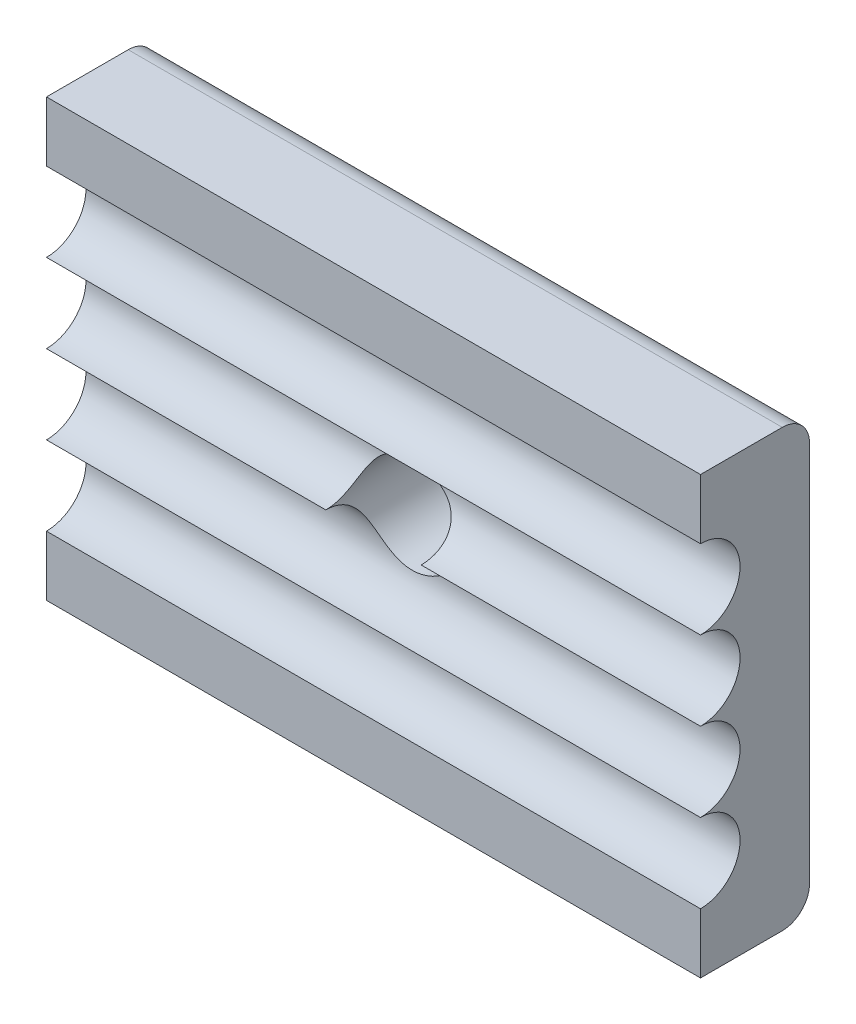
ISO-10303-21;
HEADER;
FILE_DESCRIPTION(('STEP AP214'),'2;1');
FILE_NAME('part.step','',(''),(''),'','','');
FILE_SCHEMA(('AUTOMOTIVE_DESIGN { 1 0 10303 214 1 1 1 1 }'));
ENDSEC;
DATA;
#1=APPLICATION_CONTEXT('core data for automotive mechanical design processes');
#2=APPLICATION_PROTOCOL_DEFINITION('international standard','automotive_design',2000,#1);
#3=PRODUCT_CONTEXT('',#1,'mechanical');
#4=PRODUCT('Part','Part','',(#3));
#5=PRODUCT_RELATED_PRODUCT_CATEGORY('part','',(#4));
#6=PRODUCT_DEFINITION_FORMATION('','',#4);
#7=PRODUCT_DEFINITION_CONTEXT('part definition',#1,'design');
#8=PRODUCT_DEFINITION('design','',#6,#7);
#9=PRODUCT_DEFINITION_SHAPE('','',#8);
#10=(LENGTH_UNIT() NAMED_UNIT(*) SI_UNIT(.MILLI.,.METRE.));
#11=(NAMED_UNIT(*) PLANE_ANGLE_UNIT() SI_UNIT($,.RADIAN.));
#12=(NAMED_UNIT(*) SI_UNIT($,.STERADIAN.) SOLID_ANGLE_UNIT());
#13=UNCERTAINTY_MEASURE_WITH_UNIT(LENGTH_MEASURE(1.E-05),#10,'distance_accuracy_value','');
#14=(GEOMETRIC_REPRESENTATION_CONTEXT(3) GLOBAL_UNCERTAINTY_ASSIGNED_CONTEXT((#13)) GLOBAL_UNIT_ASSIGNED_CONTEXT((#10,
#11,#12)) REPRESENTATION_CONTEXT('',''));
#15=CARTESIAN_POINT('',(0.,0.,0.));
#16=DIRECTION('',(0.,0.,1.));
#17=DIRECTION('',(1.,0.,0.));
#18=AXIS2_PLACEMENT_3D('',#15,#16,#17);
#19=CARTESIAN_POINT('',(0.,0.,4.));
#20=DIRECTION('',(0.,0.,1.));
#21=DIRECTION('',(1.,0.,0.));
#22=AXIS2_PLACEMENT_3D('',#19,#20,#21);
#23=PLANE('',#22);
#24=DIRECTION('',(-1.,0.,0.));
#25=VECTOR('',#24,1.);
#26=CARTESIAN_POINT('',(23.957345971564,1.8,4.));
#27=LINE('',#26,#25);
#28=CARTESIAN_POINT('',(18.957345971564,1.8,4.));
#29=VERTEX_POINT('',#28);
#30=CARTESIAN_POINT('',(-5.04265402843602,1.8,4.));
#31=VERTEX_POINT('',#30);
#32=EDGE_CURVE('E158',#29,#31,#27,.T.);
#33=ORIENTED_EDGE('',*,*,#32,.F.);
#34=DIRECTION('',(0.,1.,0.));
#35=VECTOR('',#34,1.);
#36=CARTESIAN_POINT('',(18.957345971564,4.,4.));
#37=LINE('',#36,#35);
#38=CARTESIAN_POINT('',(18.957345971564,4.,4.));
#39=VERTEX_POINT('',#38);
#40=EDGE_CURVE('E185',#29,#39,#37,.T.);
#41=ORIENTED_EDGE('',*,*,#40,.T.);
#42=DIRECTION('',(-1.,0.,0.));
#43=VECTOR('',#42,1.);
#44=CARTESIAN_POINT('',(-5.04265402843602,4.,4.));
#45=LINE('',#44,#43);
#46=CARTESIAN_POINT('',(-5.04265402843602,4.,4.));
#47=VERTEX_POINT('',#46);
#48=EDGE_CURVE('E180',#39,#47,#45,.T.);
#49=ORIENTED_EDGE('',*,*,#48,.T.);
#50=DIRECTION('',(0.,-1.,0.));
#51=VECTOR('',#50,1.);
#52=CARTESIAN_POINT('',(-5.04265402843602,4.,4.));
#53=LINE('',#52,#51);
#54=EDGE_CURVE('E174',#47,#31,#53,.T.);
#55=ORIENTED_EDGE('',*,*,#54,.T.);
#56=EDGE_LOOP('',(#33,#41,#49,#55));
#57=FACE_BOUND('',#56,.T.);
#58=ADVANCED_FACE('F69',(#57),#23,.T.);
#59=CARTESIAN_POINT('',(-5.04265402843602,4.,4.));
#60=DIRECTION('',(1.,0.,0.));
#61=DIRECTION('',(0.,1.,0.));
#62=AXIS2_PLACEMENT_3D('',#59,#60,#61);
#63=PLANE('',#62);
#64=CARTESIAN_POINT('',(-5.04265402843602,-2.55,4.));
#65=DIRECTION('',(-1.,0.,0.));
#66=DIRECTION('',(0.,0.,1.));
#67=AXIS2_PLACEMENT_3D('',#64,#65,#66);
#68=CIRCLE('',#67,1.45);
#69=CARTESIAN_POINT('',(-5.04265402843602,-1.1,4.));
#70=VERTEX_POINT('',#69);
#71=CARTESIAN_POINT('',(-5.04265402843602,-4.,4.));
#72=VERTEX_POINT('',#71);
#73=EDGE_CURVE('E177',#70,#72,#68,.T.);
#74=ORIENTED_EDGE('',*,*,#73,.F.);
#75=CARTESIAN_POINT('',(-5.04265402843602,0.349999999999999,4.));
#76=DIRECTION('',(-1.,0.,0.));
#77=DIRECTION('',(0.,0.,1.));
#78=AXIS2_PLACEMENT_3D('',#75,#76,#77);
#79=CIRCLE('',#78,1.45);
#80=EDGE_CURVE('E161',#31,#70,#79,.T.);
#81=ORIENTED_EDGE('',*,*,#80,.F.);
#82=ORIENTED_EDGE('',*,*,#54,.F.);
#83=DIRECTION('',(0.,0.,-1.));
#84=VECTOR('',#83,1.);
#85=CARTESIAN_POINT('',(-5.04265402843602,4.,4.));
#86=LINE('',#85,#84);
#87=CARTESIAN_POINT('',(-5.04265402843602,4.,1.));
#88=VERTEX_POINT('',#87);
#89=EDGE_CURVE('E196',#47,#88,#86,.T.);
#90=ORIENTED_EDGE('',*,*,#89,.T.);
#91=CARTESIAN_POINT('',(-5.04265402843602,3.,1.));
#92=DIRECTION('',(1.,0.,0.));
#93=DIRECTION('',(0.,1.,0.));
#94=AXIS2_PLACEMENT_3D('',#91,#92,#93);
#95=CIRCLE('',#94,1.);
#96=CARTESIAN_POINT('',(-5.04265402843602,3.,0.));
#97=VERTEX_POINT('',#96);
#98=EDGE_CURVE('E91',#88,#97,#95,.F.);
#99=ORIENTED_EDGE('',*,*,#98,.T.);
#100=DIRECTION('',(0.,-1.,0.));
#101=VECTOR('',#100,1.);
#102=CARTESIAN_POINT('',(-5.04265402843602,4.,0.));
#103=LINE('',#102,#101);
#104=CARTESIAN_POINT('',(-5.04265402843602,-11.,0.));
#105=VERTEX_POINT('',#104);
#106=EDGE_CURVE('E197',#97,#105,#103,.T.);
#107=ORIENTED_EDGE('',*,*,#106,.T.);
#108=CARTESIAN_POINT('',(-5.04265402843602,-11.,1.));
#109=DIRECTION('',(1.,0.,0.));
#110=DIRECTION('',(0.,1.,0.));
#111=AXIS2_PLACEMENT_3D('',#108,#109,#110);
#112=CIRCLE('',#111,1.);
#113=CARTESIAN_POINT('',(-5.04265402843602,-12.,1.));
#114=VERTEX_POINT('',#113);
#115=EDGE_CURVE('E227',#105,#114,#112,.F.);
#116=ORIENTED_EDGE('',*,*,#115,.T.);
#117=DIRECTION('',(0.,0.,-1.));
#118=VECTOR('',#117,1.);
#119=CARTESIAN_POINT('',(-5.04265402843602,-12.,4.));
#120=LINE('',#119,#118);
#121=CARTESIAN_POINT('',(-5.04265402843602,-12.,4.));
#122=VERTEX_POINT('',#121);
#123=EDGE_CURVE('E210',#122,#114,#120,.T.);
#124=ORIENTED_EDGE('',*,*,#123,.F.);
#125=CARTESIAN_POINT('',(-5.04265402843602,-9.8,4.));
#126=VERTEX_POINT('',#125);
#127=EDGE_CURVE('E183',#126,#122,#53,.T.);
#128=ORIENTED_EDGE('',*,*,#127,.F.);
#129=CARTESIAN_POINT('',(-5.04265402843602,-8.35,4.));
#130=DIRECTION('',(-1.,0.,0.));
#131=DIRECTION('',(0.,0.,1.));
#132=AXIS2_PLACEMENT_3D('',#129,#130,#131);
#133=CIRCLE('',#132,1.45);
#134=CARTESIAN_POINT('',(-5.04265402843602,-6.9,4.));
#135=VERTEX_POINT('',#134);
#136=EDGE_CURVE('E83',#135,#126,#133,.T.);
#137=ORIENTED_EDGE('',*,*,#136,.F.);
#138=CARTESIAN_POINT('',(-5.04265402843602,-5.45,4.));
#139=DIRECTION('',(-1.,0.,0.));
#140=DIRECTION('',(0.,0.,1.));
#141=AXIS2_PLACEMENT_3D('',#138,#139,#140);
#142=CIRCLE('',#141,1.45);
#143=EDGE_CURVE('E265',#72,#135,#142,.T.);
#144=ORIENTED_EDGE('',*,*,#143,.F.);
#145=EDGE_LOOP('',(#74,#81,#82,#90,#99,#107,#116,#124,#128,#137,#144));
#146=FACE_BOUND('',#145,.T.);
#147=ADVANCED_FACE('F172',(#146),#63,.F.);
#148=CARTESIAN_POINT('',(-5.04265402843602,-12.,4.));
#149=DIRECTION('',(0.,1.,0.));
#150=DIRECTION('',(0.,0.,1.));
#151=AXIS2_PLACEMENT_3D('',#148,#149,#150);
#152=PLANE('',#151);
#153=ORIENTED_EDGE('',*,*,#123,.T.);
#154=DIRECTION('',(1.,0.,0.));
#155=VECTOR('',#154,1.);
#156=CARTESIAN_POINT('',(-5.04265402843602,-12.,1.));
#157=LINE('',#156,#155);
#158=CARTESIAN_POINT('',(18.957345971564,-12.,1.));
#159=VERTEX_POINT('',#158);
#160=EDGE_CURVE('E213',#114,#159,#157,.T.);
#161=ORIENTED_EDGE('',*,*,#160,.T.);
#162=DIRECTION('',(0.,0.,-1.));
#163=VECTOR('',#162,1.);
#164=CARTESIAN_POINT('',(18.957345971564,-12.,4.));
#165=LINE('',#164,#163);
#166=CARTESIAN_POINT('',(18.957345971564,-12.,4.));
#167=VERTEX_POINT('',#166);
#168=EDGE_CURVE('E207',#167,#159,#165,.T.);
#169=ORIENTED_EDGE('',*,*,#168,.F.);
#170=DIRECTION('',(1.,0.,0.));
#171=VECTOR('',#170,1.);
#172=CARTESIAN_POINT('',(-5.04265402843602,-12.,4.));
#173=LINE('',#172,#171);
#174=EDGE_CURVE('E182',#122,#167,#173,.T.);
#175=ORIENTED_EDGE('',*,*,#174,.F.);
#176=EDGE_LOOP('',(#153,#161,#169,#175));
#177=FACE_BOUND('',#176,.T.);
#178=ADVANCED_FACE('F290',(#177),#152,.F.);
#179=CARTESIAN_POINT('',(18.957345971564,4.,4.));
#180=DIRECTION('',(-1.,0.,0.));
#181=DIRECTION('',(0.,0.,1.));
#182=AXIS2_PLACEMENT_3D('',#179,#180,#181);
#183=PLANE('',#182);
#184=ORIENTED_EDGE('',*,*,#40,.F.);
#185=CARTESIAN_POINT('',(18.957345971564,0.349999999999999,4.));
#186=DIRECTION('',(-1.,0.,0.));
#187=DIRECTION('',(0.,0.,1.));
#188=AXIS2_PLACEMENT_3D('',#185,#186,#187);
#189=CIRCLE('',#188,1.45);
#190=CARTESIAN_POINT('',(18.957345971564,-1.1,4.));
#191=VERTEX_POINT('',#190);
#192=EDGE_CURVE('E164',#29,#191,#189,.T.);
#193=ORIENTED_EDGE('',*,*,#192,.T.);
#194=CARTESIAN_POINT('',(18.957345971564,-2.55,4.));
#195=DIRECTION('',(-1.,0.,0.));
#196=DIRECTION('',(0.,0.,1.));
#197=AXIS2_PLACEMENT_3D('',#194,#195,#196);
#198=CIRCLE('',#197,1.45);
#199=CARTESIAN_POINT('',(18.957345971564,-4.,4.));
#200=VERTEX_POINT('',#199);
#201=EDGE_CURVE('E270',#191,#200,#198,.T.);
#202=ORIENTED_EDGE('',*,*,#201,.T.);
#203=CARTESIAN_POINT('',(18.957345971564,-5.45,4.));
#204=DIRECTION('',(-1.,0.,0.));
#205=DIRECTION('',(0.,0.,1.));
#206=AXIS2_PLACEMENT_3D('',#203,#204,#205);
#207=CIRCLE('',#206,1.45);
#208=CARTESIAN_POINT('',(18.957345971564,-6.9,4.));
#209=VERTEX_POINT('',#208);
#210=EDGE_CURVE('E264',#200,#209,#207,.T.);
#211=ORIENTED_EDGE('',*,*,#210,.T.);
#212=CARTESIAN_POINT('',(18.957345971564,-8.35,4.));
#213=DIRECTION('',(-1.,0.,0.));
#214=DIRECTION('',(0.,0.,1.));
#215=AXIS2_PLACEMENT_3D('',#212,#213,#214);
#216=CIRCLE('',#215,1.45);
#217=CARTESIAN_POINT('',(18.957345971564,-9.8,4.));
#218=VERTEX_POINT('',#217);
#219=EDGE_CURVE('E189',#209,#218,#216,.T.);
#220=ORIENTED_EDGE('',*,*,#219,.T.);
#221=EDGE_CURVE('E192',#167,#218,#37,.T.);
#222=ORIENTED_EDGE('',*,*,#221,.F.);
#223=ORIENTED_EDGE('',*,*,#168,.T.);
#224=CARTESIAN_POINT('',(18.957345971564,-11.,1.));
#225=DIRECTION('',(-1.,0.,0.));
#226=DIRECTION('',(0.,0.,1.));
#227=AXIS2_PLACEMENT_3D('',#224,#225,#226);
#228=CIRCLE('',#227,1.);
#229=CARTESIAN_POINT('',(18.957345971564,-11.,0.));
#230=VERTEX_POINT('',#229);
#231=EDGE_CURVE('E220',#159,#230,#228,.F.);
#232=ORIENTED_EDGE('',*,*,#231,.T.);
#233=DIRECTION('',(0.,1.,0.));
#234=VECTOR('',#233,1.);
#235=CARTESIAN_POINT('',(18.957345971564,4.,0.));
#236=LINE('',#235,#234);
#237=CARTESIAN_POINT('',(18.957345971564,3.,0.));
#238=VERTEX_POINT('',#237);
#239=EDGE_CURVE('E187',#230,#238,#236,.T.);
#240=ORIENTED_EDGE('',*,*,#239,.T.);
#241=CARTESIAN_POINT('',(18.957345971564,3.,1.));
#242=DIRECTION('',(-1.,0.,0.));
#243=DIRECTION('',(0.,0.,1.));
#244=AXIS2_PLACEMENT_3D('',#241,#242,#243);
#245=CIRCLE('',#244,1.);
#246=CARTESIAN_POINT('',(18.957345971564,4.,1.));
#247=VERTEX_POINT('',#246);
#248=EDGE_CURVE('E218',#238,#247,#245,.F.);
#249=ORIENTED_EDGE('',*,*,#248,.T.);
#250=DIRECTION('',(0.,0.,-1.));
#251=VECTOR('',#250,1.);
#252=CARTESIAN_POINT('',(18.957345971564,4.,4.));
#253=LINE('',#252,#251);
#254=EDGE_CURVE('E204',#39,#247,#253,.T.);
#255=ORIENTED_EDGE('',*,*,#254,.F.);
#256=EDGE_LOOP('',(#184,#193,#202,#211,#220,#222,#223,#232,#240,#249,#255));
#257=FACE_BOUND('',#256,.T.);
#258=ADVANCED_FACE('F282',(#257),#183,.F.);
#259=CARTESIAN_POINT('',(-5.04265402843602,4.,4.));
#260=DIRECTION('',(0.,-1.,0.));
#261=DIRECTION('',(0.,0.,-1.));
#262=AXIS2_PLACEMENT_3D('',#259,#260,#261);
#263=PLANE('',#262);
#264=ORIENTED_EDGE('',*,*,#254,.T.);
#265=DIRECTION('',(-1.,0.,0.));
#266=VECTOR('',#265,1.);
#267=CARTESIAN_POINT('',(-5.04265402843602,4.,1.));
#268=LINE('',#267,#266);
#269=EDGE_CURVE('E229',#247,#88,#268,.T.);
#270=ORIENTED_EDGE('',*,*,#269,.T.);
#271=ORIENTED_EDGE('',*,*,#89,.F.);
#272=ORIENTED_EDGE('',*,*,#48,.F.);
#273=EDGE_LOOP('',(#264,#270,#271,#272));
#274=FACE_BOUND('',#273,.T.);
#275=ADVANCED_FACE('F303',(#274),#263,.F.);
#276=DIRECTION('',(-1.,0.,0.));
#277=VECTOR('',#276,1.);
#278=CARTESIAN_POINT('',(23.957345971564,-9.8,4.));
#279=LINE('',#278,#277);
#280=EDGE_CURVE('E77',#126,#218,#279,.F.);
#281=ORIENTED_EDGE('',*,*,#280,.F.);
#282=ORIENTED_EDGE('',*,*,#127,.T.);
#283=ORIENTED_EDGE('',*,*,#174,.T.);
#284=ORIENTED_EDGE('',*,*,#221,.T.);
#285=EDGE_LOOP('',(#281,#282,#283,#284));
#286=FACE_BOUND('',#285,.T.);
#287=ADVANCED_FACE('F284',(#286),#23,.T.);
#288=CARTESIAN_POINT('',(0.,0.,0.));
#289=DIRECTION('',(0.,0.,1.));
#290=DIRECTION('',(1.,0.,0.));
#291=AXIS2_PLACEMENT_3D('',#288,#289,#290);
#292=PLANE('',#291);
#293=CARTESIAN_POINT('',(6.95734597156398,-4.,0.));
#294=DIRECTION('',(0.,0.,1.));
#295=DIRECTION('',(1.,0.,0.));
#296=AXIS2_PLACEMENT_3D('',#293,#294,#295);
#297=CIRCLE('',#296,1.75);
#298=CARTESIAN_POINT('',(8.70734597156398,-4.,0.));
#299=VERTEX_POINT('',#298);
#300=EDGE_CURVE('E200',#299,#299,#297,.T.);
#301=ORIENTED_EDGE('',*,*,#300,.T.);
#302=EDGE_LOOP('',(#301));
#303=FACE_BOUND('',#302,.T.);
#304=ORIENTED_EDGE('',*,*,#239,.F.);
#305=DIRECTION('',(1.,0.,0.));
#306=VECTOR('',#305,1.);
#307=CARTESIAN_POINT('',(0.,-11.,0.));
#308=LINE('',#307,#306);
#309=EDGE_CURVE('E224',#230,#105,#308,.F.);
#310=ORIENTED_EDGE('',*,*,#309,.T.);
#311=ORIENTED_EDGE('',*,*,#106,.F.);
#312=DIRECTION('',(-1.,0.,0.));
#313=VECTOR('',#312,1.);
#314=CARTESIAN_POINT('',(0.,3.,0.));
#315=LINE('',#314,#313);
#316=EDGE_CURVE('E222',#97,#238,#315,.F.);
#317=ORIENTED_EDGE('',*,*,#316,.T.);
#318=EDGE_LOOP('',(#304,#310,#311,#317));
#319=FACE_BOUND('',#318,.T.);
#320=ADVANCED_FACE('F297',(#303,#319),#292,.F.);
#321=CARTESIAN_POINT('',(6.95734597156398,-4.,-1.));
#322=DIRECTION('',(0.,0.,1.));
#323=DIRECTION('',(1.,0.,0.));
#324=AXIS2_PLACEMENT_3D('',#321,#322,#323);
#325=CYLINDRICAL_SURFACE('',#324,1.75);
#326=CARTESIAN_POINT('',(8.70734597156398,-4.,4.));
#327=CARTESIAN_POINT('',(8.70733565516009,-4.00000376669205,3.95950347170287));
#328=CARTESIAN_POINT('',(8.70734570697573,-3.99830348125043,3.91900882092507));
#329=CARTESIAN_POINT('',(8.70733145373947,-3.991524016124,3.83830406462161));
#330=CARTESIAN_POINT('',(8.70730714933721,-3.98644490033016,3.79809395373006));
#331=CARTESIAN_POINT('',(8.70714902016408,-3.97293053129448,3.71819937660366));
#332=CARTESIAN_POINT('',(8.70701509080503,-3.96449207701134,3.67851544913331));
#333=CARTESIAN_POINT('',(8.7064889593383,-3.94432766037062,3.60000573424634));
#334=CARTESIAN_POINT('',(8.70609676048522,-3.9326017394413,3.56117993602232));
#335=CARTESIAN_POINT('',(8.70425375279459,-3.89257663262573,3.44633214027787));
#336=CARTESIAN_POINT('',(8.70213653402643,-3.85943007259126,3.37193956453441));
#337=CARTESIAN_POINT('',(8.69406713907167,-3.78129831886115,3.22995484600408));
#338=CARTESIAN_POINT('',(8.68811749515974,-3.73632095397085,3.162358246847));
#339=CARTESIAN_POINT('',(8.67011902587622,-3.6375775306464,3.03781091559414));
#340=CARTESIAN_POINT('',(8.65824257467923,-3.58408743352287,2.98061838335936));
#341=CARTESIAN_POINT('',(8.62620640146073,-3.47000687264625,2.87659943638053));
#342=CARTESIAN_POINT('',(8.60605541302909,-3.4094239432721,2.8297621718278));
#343=CARTESIAN_POINT('',(8.55838827138807,-3.29089946524595,2.75176338537125));
#344=CARTESIAN_POINT('',(8.53181204732878,-3.23330119119849,2.71950161011116));
#345=CARTESIAN_POINT('',(8.47028666507739,-3.11808744124755,2.66438935345029));
#346=CARTESIAN_POINT('',(8.43533766752823,-3.06047196569528,2.64153869150749));
#347=CARTESIAN_POINT('',(8.35895623168394,-2.95008120980309,2.60511840940971));
#348=CARTESIAN_POINT('',(8.31781585155274,-2.89720545636091,2.59123306506017));
#349=CARTESIAN_POINT('',(8.22898463962031,-2.79584751438361,2.57005451842911));
#350=CARTESIAN_POINT('',(8.18129143810606,-2.74736692585845,2.56276370821136));
#351=CARTESIAN_POINT('',(8.07423606763669,-2.65060389043456,2.55257950012423));
#352=CARTESIAN_POINT('',(8.01416032710829,-2.60304783717802,2.55032111248084));
#353=CARTESIAN_POINT('',(7.88829248298237,-2.5161872026697,2.54974267812244));
#354=CARTESIAN_POINT('',(7.82249592651164,-2.47688913190282,2.55142572618354));
#355=CARTESIAN_POINT('',(7.67347261839893,-2.40064839657158,2.55711153973906));
#356=CARTESIAN_POINT('',(7.58930526561379,-2.36556248064698,2.56149337456995));
#357=CARTESIAN_POINT('',(7.41652829095744,-2.3088683977235,2.5699022741655));
#358=CARTESIAN_POINT('',(7.32791764048666,-2.28726336718395,2.57392925618317));
#359=CARTESIAN_POINT('',(7.14098661008918,-2.25688626833454,2.5798392153089));
#360=CARTESIAN_POINT('',(7.04246293506809,-2.2493017708614,2.58152101970474));
#361=CARTESIAN_POINT('',(6.84556016010868,-2.25079983456607,2.58120530363571));
#362=CARTESIAN_POINT('',(6.74718105647086,-2.2598819615506,2.57920787902086));
#363=CARTESIAN_POINT('',(6.555314700534,-2.29407401884074,2.57266353858147));
#364=CARTESIAN_POINT('',(6.46176971519918,-2.31887174382803,2.56816648948252));
#365=CARTESIAN_POINT('',(6.27995539662967,-2.38353082085323,2.55921862613383));
#366=CARTESIAN_POINT('',(6.19169132192012,-2.42340690742924,2.55476786149854));
#367=CARTESIAN_POINT('',(6.02088240127815,-2.51835884969023,2.54955215704365));
#368=CARTESIAN_POINT('',(5.93850804175433,-2.57375251483716,2.54887124389183));
#369=CARTESIAN_POINT('',(5.82313272108256,-2.66639510252547,2.55435009452865));
#370=CARTESIAN_POINT('',(5.78605382089066,-2.69885086499187,2.55725691992886));
#371=CARTESIAN_POINT('',(5.71493257686436,-2.76658299021268,2.56585968006157));
#372=CARTESIAN_POINT('',(5.68088889096634,-2.80185809313882,2.57155437479489));
#373=CARTESIAN_POINT('',(5.60198793359255,-2.89076312250722,2.58959700756132));
#374=CARTESIAN_POINT('',(5.55893199269781,-2.94566078434543,2.60376715046082));
#375=CARTESIAN_POINT('',(5.48082013433796,-3.05816260621433,2.64067423260524));
#376=CARTESIAN_POINT('',(5.44575742324161,-3.11576441732627,2.66340385304469));
#377=CARTESIAN_POINT('',(5.38390952840373,-3.23117150517578,2.71836185540442));
#378=CARTESIAN_POINT('',(5.35714946763391,-3.28897687431502,2.75061850127359));
#379=CARTESIAN_POINT('',(5.31168336669551,-3.40167265665371,2.82454458266642));
#380=CARTESIAN_POINT('',(5.29297963056775,-3.45656223203131,2.86621670574913));
#381=CARTESIAN_POINT('',(5.26315263155098,-3.55851047552764,2.95605390237653));
#382=CARTESIAN_POINT('',(5.25173231784705,-3.60580729588861,3.00385308734594));
#383=CARTESIAN_POINT('',(5.23378216357141,-3.69366294804923,3.10608589552964));
#384=CARTESIAN_POINT('',(5.22725373668868,-3.73421982946485,3.16052143127921));
#385=CARTESIAN_POINT('',(5.21719938531948,-3.81031142755316,3.279255600521));
#386=CARTESIAN_POINT('',(5.21395151178682,-3.84519596785285,3.34399372073236));
#387=CARTESIAN_POINT('',(5.20968109684765,-3.90479458200028,3.47806311938934));
#388=CARTESIAN_POINT('',(5.20865915869169,-3.92950589733209,3.54739563771796));
#389=CARTESIAN_POINT('',(5.2075982095584,-3.96579745335228,3.68036115519716));
#390=CARTESIAN_POINT('',(5.20745448033956,-3.97861199473729,3.74365737226552));
#391=CARTESIAN_POINT('',(5.20736234968733,-3.99143738241061,3.83938855927058));
#392=CARTESIAN_POINT('',(5.20735220362643,-3.99464643733859,3.8714218920228));
#393=CARTESIAN_POINT('',(5.2073456379251,-3.99892791360994,3.93563387905301));
#394=CARTESIAN_POINT('',(5.20734921949547,-4.00000014647132,3.96781254589955));
#395=CARTESIAN_POINT('',(5.20734597156398,-4.,4.));
#396=B_SPLINE_CURVE_WITH_KNOTS('',3,(#326,#327,#328,#329,#330,#331,#332,#333,#334,#335,#336,
#337,#338,#339,#340,#341,#342,#343,#344,#345,#346,#347,#348,#349,#350,#351,#352,#353,#354,#355,
#356,#357,#358,#359,#360,#361,#362,#363,#364,#365,#366,#367,#368,#369,#370,#371,#372,#373,#374,
#375,#376,#377,#378,#379,#380,#381,#382,#383,#384,#385,#386,#387,#388,#389,#390,#391,#392,#393,
#394,#395),.UNSPECIFIED.,.F.,.F.,(4,2,2,2,2,2,2,2,2,2,2,2,2,2,2,2,2,2,2,2,2,2,2,2,2,2,2,2,2,2,2,
2,2,2,4),(0.,0.121450491150878,0.242898685835263,0.364462883953561,0.486025550203311,
0.729150350388306,0.972114670434953,1.20839190408096,1.44442039078178,1.65680662860573,
1.86918879183998,2.07361170715427,2.27810874397028,2.50722300397813,2.73651722253453,
3.00925200180987,3.28205021185212,3.57705108684687,3.87204427668725,4.1613533610251,
4.45094589118067,4.74696796029453,4.89484307179298,5.04265247050917,5.25525370736707,
5.46767357018101,5.68073006254754,5.89384744687994,6.09759770470148,6.30140682090117,
6.52132238183589,6.74129753465546,6.93443222433302,7.03095072760383,7.12747774407541),.UNSPECIFIED.);
#397=CARTESIAN_POINT('',(8.70734597156398,-4.,4.));
#398=VERTEX_POINT('',#397);
#399=CARTESIAN_POINT('',(5.20734597156398,-4.,4.));
#400=VERTEX_POINT('',#399);
#401=EDGE_CURVE('E231',#398,#400,#396,.T.);
#402=ORIENTED_EDGE('',*,*,#401,.T.);
#403=CARTESIAN_POINT('',(5.20734597156398,-4.,4.));
#404=CARTESIAN_POINT('',(5.20735628796787,-3.99999623330796,3.95950347170287));
#405=CARTESIAN_POINT('',(5.20734623615223,-4.00169651874957,3.91900882092507));
#406=CARTESIAN_POINT('',(5.20736048938849,-4.008475983876,3.83830406462161));
#407=CARTESIAN_POINT('',(5.20738479379075,-4.01355509966984,3.79809395373006));
#408=CARTESIAN_POINT('',(5.20754292296388,-4.02706946870552,3.71819937660366));
#409=CARTESIAN_POINT('',(5.20767685232293,-4.03550792298866,3.67851544913332));
#410=CARTESIAN_POINT('',(5.20820298378966,-4.05567233962938,3.60000573424634));
#411=CARTESIAN_POINT('',(5.20859518264275,-4.0673982605587,3.56117993602232));
#412=CARTESIAN_POINT('',(5.21043819033338,-4.10742336737427,3.44633214027787));
#413=CARTESIAN_POINT('',(5.21255540910154,-4.14056992740874,3.37193956453441));
#414=CARTESIAN_POINT('',(5.22062480405629,-4.21870168113885,3.22995484600408));
#415=CARTESIAN_POINT('',(5.22657444796822,-4.26367904602915,3.16235824684701));
#416=CARTESIAN_POINT('',(5.24457291725175,-4.3624224693536,3.03781091559414));
#417=CARTESIAN_POINT('',(5.25644936844873,-4.41591256647713,2.98061838335936));
#418=CARTESIAN_POINT('',(5.28848554166723,-4.52999312735375,2.87659943638053));
#419=CARTESIAN_POINT('',(5.30863653009887,-4.5905760567279,2.82976217182781));
#420=CARTESIAN_POINT('',(5.35630367173989,-4.70910053475405,2.75176338537125));
#421=CARTESIAN_POINT('',(5.38287989579919,-4.76669880880151,2.71950161011116));
#422=CARTESIAN_POINT('',(5.44440527805058,-4.88191255875245,2.66438935345029));
#423=CARTESIAN_POINT('',(5.47935427559974,-4.93952803430472,2.64153869150749));
#424=CARTESIAN_POINT('',(5.55573571144403,-5.0499187901969,2.60511840940971));
#425=CARTESIAN_POINT('',(5.59687609157522,-5.10279454363909,2.59123306506017));
#426=CARTESIAN_POINT('',(5.68570730350766,-5.20415248561638,2.57005451842911));
#427=CARTESIAN_POINT('',(5.7334005050219,-5.25263307414154,2.56276370821136));
#428=CARTESIAN_POINT('',(5.84045587549127,-5.34939610956544,2.55257950012423));
#429=CARTESIAN_POINT('',(5.90053161601967,-5.39695216282198,2.55032111248084));
#430=CARTESIAN_POINT('',(6.02639946014559,-5.4838127973303,2.54974267812244));
#431=CARTESIAN_POINT('',(6.09219601661633,-5.52311086809718,2.55142572618354));
#432=CARTESIAN_POINT('',(6.24121932472904,-5.59935160342842,2.55711153973906));
#433=CARTESIAN_POINT('',(6.32538667751418,-5.63443751935302,2.56149337456995));
#434=CARTESIAN_POINT('',(6.49816365217053,-5.6911316022765,2.5699022741655));
#435=CARTESIAN_POINT('',(6.5867743026413,-5.71273663281605,2.57392925618317));
#436=CARTESIAN_POINT('',(6.77370533303878,-5.74311373166546,2.5798392153089));
#437=CARTESIAN_POINT('',(6.87222900805987,-5.7506982291386,2.58152101970474));
#438=CARTESIAN_POINT('',(7.06913178301928,-5.74920016543393,2.58120530363571));
#439=CARTESIAN_POINT('',(7.1675108866571,-5.7401180384494,2.57920787902086));
#440=CARTESIAN_POINT('',(7.35937724259396,-5.70592598115926,2.57266353858147));
#441=CARTESIAN_POINT('',(7.45292222792878,-5.68112825617197,2.56816648948252));
#442=CARTESIAN_POINT('',(7.63473654649829,-5.61646917914677,2.55921862613383));
#443=CARTESIAN_POINT('',(7.72300062120784,-5.57659309257076,2.55476786149854));
#444=CARTESIAN_POINT('',(7.89380954184981,-5.48164115030977,2.54955215704365));
#445=CARTESIAN_POINT('',(7.97618390137364,-5.42624748516284,2.54887124389183));
#446=CARTESIAN_POINT('',(8.0915592220454,-5.33360489747453,2.55435009452865));
#447=CARTESIAN_POINT('',(8.1286381222373,-5.30114913500814,2.55725691992886));
#448=CARTESIAN_POINT('',(8.1997593662636,-5.23341700978732,2.56585968006157));
#449=CARTESIAN_POINT('',(8.23380305216163,-5.19814190686118,2.57155437479489));
#450=CARTESIAN_POINT('',(8.31270400953542,-5.10923687749278,2.58959700756132));
#451=CARTESIAN_POINT('',(8.35575995043015,-5.05433921565458,2.60376715046082));
#452=CARTESIAN_POINT('',(8.43387180879001,-4.94183739378568,2.64067423260524));
#453=CARTESIAN_POINT('',(8.46893451988635,-4.88423558267373,2.66340385304469));
#454=CARTESIAN_POINT('',(8.53078241472423,-4.76882849482422,2.71836185540442));
#455=CARTESIAN_POINT('',(8.55754247549406,-4.71102312568498,2.75061850127359));
#456=CARTESIAN_POINT('',(8.60300857643246,-4.59832734334629,2.82454458266642));
#457=CARTESIAN_POINT('',(8.62171231256021,-4.5434377679687,2.86621670574913));
#458=CARTESIAN_POINT('',(8.65153931157698,-4.44148952447236,2.95605390237652));
#459=CARTESIAN_POINT('',(8.66295962528092,-4.3941927041114,3.00385308734594));
#460=CARTESIAN_POINT('',(8.68090977955656,-4.30633705195077,3.10608589552963));
#461=CARTESIAN_POINT('',(8.68743820643928,-4.26578017053515,3.16052143127921));
#462=CARTESIAN_POINT('',(8.69749255780848,-4.18968857244684,3.27925560052099));
#463=CARTESIAN_POINT('',(8.70074043134115,-4.15480403214716,3.34399372073236));
#464=CARTESIAN_POINT('',(8.70501084628032,-4.09520541799972,3.47806311938934));
#465=CARTESIAN_POINT('',(8.70603278443627,-4.07049410266791,3.54739563771796));
#466=CARTESIAN_POINT('',(8.70709373356957,-4.03420254664772,3.68036115519716));
#467=CARTESIAN_POINT('',(8.7072374627884,-4.02138800526271,3.74365737226552));
#468=CARTESIAN_POINT('',(8.70732959344063,-4.00856261758939,3.83938855927058));
#469=CARTESIAN_POINT('',(8.70733973950154,-4.00535356266141,3.8714218920228));
#470=CARTESIAN_POINT('',(8.70734630520286,-4.00107208639006,3.93563387905301));
#471=CARTESIAN_POINT('',(8.7073427236325,-3.99999985352868,3.96781254589955));
#472=CARTESIAN_POINT('',(8.70734597156398,-4.,4.));
#473=B_SPLINE_CURVE_WITH_KNOTS('',3,(#403,#404,#405,#406,#407,#408,#409,#410,#411,#412,#413,
#414,#415,#416,#417,#418,#419,#420,#421,#422,#423,#424,#425,#426,#427,#428,#429,#430,#431,#432,
#433,#434,#435,#436,#437,#438,#439,#440,#441,#442,#443,#444,#445,#446,#447,#448,#449,#450,#451,
#452,#453,#454,#455,#456,#457,#458,#459,#460,#461,#462,#463,#464,#465,#466,#467,#468,#469,#470,
#471,#472),.UNSPECIFIED.,.F.,.F.,(4,2,2,2,2,2,2,2,2,2,2,2,2,2,2,2,2,2,2,2,2,2,2,2,2,2,2,2,2,2,2,
2,2,2,4),(0.,0.121450491150878,0.242898685835263,0.36446288395356,0.486025550203311,
0.729150350388306,0.972114670434952,1.20839190408096,1.44442039078178,1.65680662860572,
1.86918879183998,2.07361170715427,2.27810874397028,2.50722300397813,2.73651722253453,
3.00925200180987,3.28205021185211,3.57705108684687,3.87204427668725,4.1613533610251,
4.45094589118066,4.74696796029452,4.89484307179298,5.04265247050916,5.25525370736706,
5.46767357018101,5.68073006254754,5.89384744687994,6.09759770470147,6.30140682090116,
6.52132238183589,6.74129753465546,6.93443222433301,7.03095072760383,7.12747774407541),.UNSPECIFIED.);
#474=EDGE_CURVE('E256',#400,#398,#473,.T.);
#475=ORIENTED_EDGE('',*,*,#474,.T.);
#476=EDGE_LOOP('',(#402,#475));
#477=FACE_BOUND('',#476,.T.);
#478=ORIENTED_EDGE('',*,*,#300,.F.);
#479=EDGE_LOOP('',(#478));
#480=FACE_BOUND('',#479,.T.);
#481=ADVANCED_FACE('F239',(#477,#480),#325,.F.);
#482=CARTESIAN_POINT('',(-5.04265402843602,-11.,1.));
#483=DIRECTION('',(1.,0.,0.));
#484=DIRECTION('',(0.,0.,-1.));
#485=AXIS2_PLACEMENT_3D('',#482,#483,#484);
#486=CYLINDRICAL_SURFACE('',#485,1.);
#487=ORIENTED_EDGE('',*,*,#115,.F.);
#488=ORIENTED_EDGE('',*,*,#309,.F.);
#489=ORIENTED_EDGE('',*,*,#231,.F.);
#490=ORIENTED_EDGE('',*,*,#160,.F.);
#491=EDGE_LOOP('',(#487,#488,#489,#490));
#492=FACE_BOUND('',#491,.T.);
#493=ADVANCED_FACE('F300',(#492),#486,.T.);
#494=CARTESIAN_POINT('',(-5.04265402843602,3.,1.));
#495=DIRECTION('',(-1.,0.,0.));
#496=DIRECTION('',(0.,0.,1.));
#497=AXIS2_PLACEMENT_3D('',#494,#495,#496);
#498=CYLINDRICAL_SURFACE('',#497,1.);
#499=ORIENTED_EDGE('',*,*,#248,.F.);
#500=ORIENTED_EDGE('',*,*,#316,.F.);
#501=ORIENTED_EDGE('',*,*,#98,.F.);
#502=ORIENTED_EDGE('',*,*,#269,.F.);
#503=EDGE_LOOP('',(#499,#500,#501,#502));
#504=FACE_BOUND('',#503,.T.);
#505=ADVANCED_FACE('F71',(#504),#498,.T.);
#506=CARTESIAN_POINT('',(23.957345971564,-2.55,4.));
#507=DIRECTION('',(-1.,0.,0.));
#508=DIRECTION('',(0.,0.,1.));
#509=AXIS2_PLACEMENT_3D('',#506,#507,#508);
#510=CYLINDRICAL_SURFACE('',#509,1.45);
#511=DIRECTION('',(-1.,0.,0.));
#512=VECTOR('',#511,1.);
#513=CARTESIAN_POINT('',(23.957345971564,-1.1,4.));
#514=LINE('',#513,#512);
#515=EDGE_CURVE('E273',#191,#70,#514,.T.);
#516=ORIENTED_EDGE('',*,*,#515,.T.);
#517=ORIENTED_EDGE('',*,*,#73,.T.);
#518=DIRECTION('',(-1.,0.,0.));
#519=VECTOR('',#518,1.);
#520=CARTESIAN_POINT('',(23.957345971564,-4.,4.));
#521=LINE('',#520,#519);
#522=EDGE_CURVE('E274',#400,#72,#521,.T.);
#523=ORIENTED_EDGE('',*,*,#522,.F.);
#524=ORIENTED_EDGE('',*,*,#401,.F.);
#525=EDGE_CURVE('E271',#200,#398,#521,.T.);
#526=ORIENTED_EDGE('',*,*,#525,.F.);
#527=ORIENTED_EDGE('',*,*,#201,.F.);
#528=EDGE_LOOP('',(#516,#517,#523,#524,#526,#527));
#529=FACE_BOUND('',#528,.T.);
#530=ADVANCED_FACE('F242',(#529),#510,.F.);
#531=CARTESIAN_POINT('',(23.957345971564,-8.35,4.));
#532=DIRECTION('',(-1.,0.,0.));
#533=DIRECTION('',(0.,0.,1.));
#534=AXIS2_PLACEMENT_3D('',#531,#532,#533);
#535=CYLINDRICAL_SURFACE('',#534,1.45);
#536=DIRECTION('',(-1.,0.,0.));
#537=VECTOR('',#536,1.);
#538=CARTESIAN_POINT('',(23.957345971564,-6.9,4.));
#539=LINE('',#538,#537);
#540=EDGE_CURVE('E12',#209,#135,#539,.T.);
#541=ORIENTED_EDGE('',*,*,#540,.T.);
#542=ORIENTED_EDGE('',*,*,#136,.T.);
#543=ORIENTED_EDGE('',*,*,#280,.T.);
#544=ORIENTED_EDGE('',*,*,#219,.F.);
#545=EDGE_LOOP('',(#541,#542,#543,#544));
#546=FACE_BOUND('',#545,.T.);
#547=ADVANCED_FACE('F246',(#546),#535,.F.);
#548=CARTESIAN_POINT('',(23.957345971564,-5.45,4.));
#549=DIRECTION('',(-1.,0.,0.));
#550=DIRECTION('',(0.,0.,1.));
#551=AXIS2_PLACEMENT_3D('',#548,#549,#550);
#552=CYLINDRICAL_SURFACE('',#551,1.45);
#553=ORIENTED_EDGE('',*,*,#525,.T.);
#554=ORIENTED_EDGE('',*,*,#474,.F.);
#555=ORIENTED_EDGE('',*,*,#522,.T.);
#556=ORIENTED_EDGE('',*,*,#143,.T.);
#557=ORIENTED_EDGE('',*,*,#540,.F.);
#558=ORIENTED_EDGE('',*,*,#210,.F.);
#559=EDGE_LOOP('',(#553,#554,#555,#556,#557,#558));
#560=FACE_BOUND('',#559,.T.);
#561=ADVANCED_FACE('F250',(#560),#552,.F.);
#562=CARTESIAN_POINT('',(23.957345971564,0.349999999999999,4.));
#563=DIRECTION('',(-1.,0.,0.));
#564=DIRECTION('',(0.,0.,1.));
#565=AXIS2_PLACEMENT_3D('',#562,#563,#564);
#566=CYLINDRICAL_SURFACE('',#565,1.45);
#567=ORIENTED_EDGE('',*,*,#32,.T.);
#568=ORIENTED_EDGE('',*,*,#80,.T.);
#569=ORIENTED_EDGE('',*,*,#515,.F.);
#570=ORIENTED_EDGE('',*,*,#192,.F.);
#571=EDGE_LOOP('',(#567,#568,#569,#570));
#572=FACE_BOUND('',#571,.T.);
#573=ADVANCED_FACE('F160',(#572),#566,.F.);
#574=CLOSED_SHELL('',(#58,#147,#178,#258,#275,#287,#320,#481,#493,#505,#530,#547,#561,#573));
#575=MANIFOLD_SOLID_BREP('B2',#574);
#576=ADVANCED_BREP_SHAPE_REPRESENTATION('',(#18,#575),#14);
#577=SHAPE_DEFINITION_REPRESENTATION(#9,#576);
ENDSEC;
END-ISO-10303-21;
